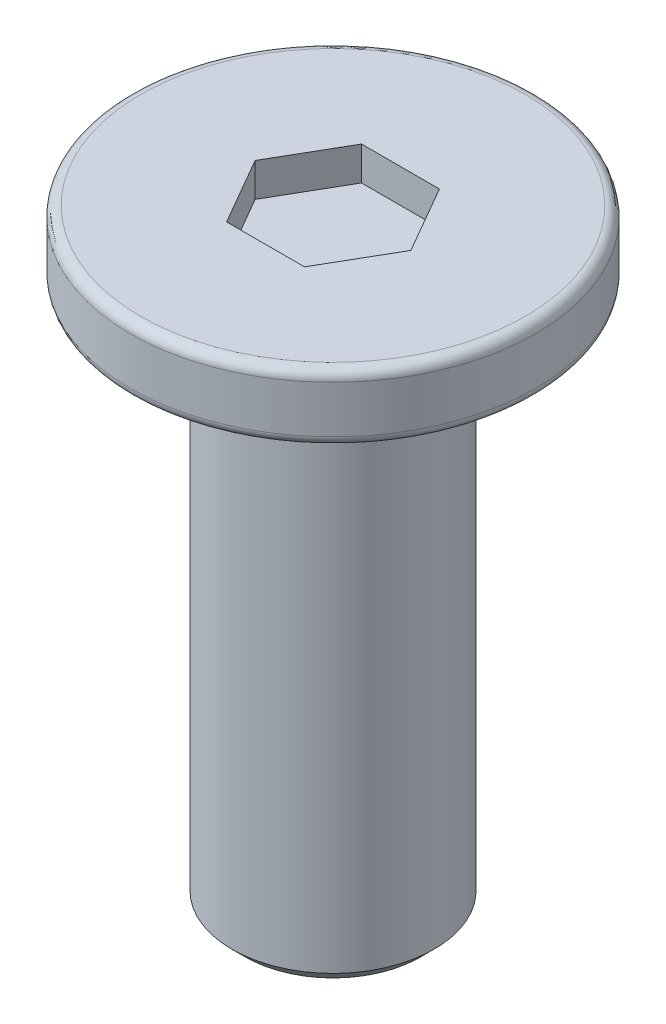
ISO-10303-21;
HEADER;
FILE_DESCRIPTION(('STEP AP214'),'2;1');
FILE_NAME('part.step','',(''),(''),'','','');
FILE_SCHEMA(('AUTOMOTIVE_DESIGN { 1 0 10303 214 1 1 1 1 }'));
ENDSEC;
DATA;
#1=APPLICATION_CONTEXT('core data for automotive mechanical design processes');
#2=APPLICATION_PROTOCOL_DEFINITION('international standard','automotive_design',2000,#1);
#3=PRODUCT_CONTEXT('',#1,'mechanical');
#4=PRODUCT('Part','Part','',(#3));
#5=PRODUCT_RELATED_PRODUCT_CATEGORY('part','',(#4));
#6=PRODUCT_DEFINITION_FORMATION('','',#4);
#7=PRODUCT_DEFINITION_CONTEXT('part definition',#1,'design');
#8=PRODUCT_DEFINITION('design','',#6,#7);
#9=PRODUCT_DEFINITION_SHAPE('','',#8);
#10=(LENGTH_UNIT() NAMED_UNIT(*) SI_UNIT(.MILLI.,.METRE.));
#11=(NAMED_UNIT(*) PLANE_ANGLE_UNIT() SI_UNIT($,.RADIAN.));
#12=(NAMED_UNIT(*) SI_UNIT($,.STERADIAN.) SOLID_ANGLE_UNIT());
#13=UNCERTAINTY_MEASURE_WITH_UNIT(LENGTH_MEASURE(1.E-05),#10,'distance_accuracy_value','');
#14=(GEOMETRIC_REPRESENTATION_CONTEXT(3) GLOBAL_UNCERTAINTY_ASSIGNED_CONTEXT((#13)) GLOBAL_UNIT_ASSIGNED_CONTEXT((#10,
#11,#12)) REPRESENTATION_CONTEXT('',''));
#15=CARTESIAN_POINT('',(0.,0.,0.));
#16=DIRECTION('',(0.,0.,1.));
#17=DIRECTION('',(1.,0.,0.));
#18=AXIS2_PLACEMENT_3D('',#15,#16,#17);
#19=CARTESIAN_POINT('',(0.,1.,0.));
#20=DIRECTION('',(0.,-1.,0.));
#21=DIRECTION('',(0.,0.,-1.));
#22=AXIS2_PLACEMENT_3D('',#19,#20,#21);
#23=CYLINDRICAL_SURFACE('',#22,3.);
#24=CARTESIAN_POINT('',(0.,0.15,0.));
#25=DIRECTION('',(0.,1.,0.));
#26=DIRECTION('',(0.,0.,1.));
#27=AXIS2_PLACEMENT_3D('',#24,#25,#26);
#28=CIRCLE('',#27,3.);
#29=CARTESIAN_POINT('',(0.,0.15,3.));
#30=VERTEX_POINT('',#29);
#31=EDGE_CURVE('E174',#30,#30,#28,.T.);
#32=ORIENTED_EDGE('',*,*,#31,.T.);
#33=EDGE_LOOP('',(#32));
#34=FACE_BOUND('',#33,.T.);
#35=CARTESIAN_POINT('',(0.,0.85,0.));
#36=DIRECTION('',(0.,1.,0.));
#37=DIRECTION('',(0.,0.,1.));
#38=AXIS2_PLACEMENT_3D('',#35,#36,#37);
#39=CIRCLE('',#38,3.);
#40=CARTESIAN_POINT('',(0.,0.85,3.));
#41=VERTEX_POINT('',#40);
#42=EDGE_CURVE('E170',#41,#41,#39,.F.);
#43=ORIENTED_EDGE('',*,*,#42,.T.);
#44=EDGE_LOOP('',(#43));
#45=FACE_BOUND('',#44,.T.);
#46=ADVANCED_FACE('F41',(#34,#45),#23,.T.);
#47=CARTESIAN_POINT('',(0.,1.,0.));
#48=DIRECTION('',(0.,1.,0.));
#49=DIRECTION('',(0.,0.,1.));
#50=AXIS2_PLACEMENT_3D('',#47,#48,#49);
#51=PLANE('',#50);
#52=DIRECTION('',(0.5,0.,-0.866025403784439));
#53=VECTOR('',#52,1.);
#54=CARTESIAN_POINT('',(0.577350269189626,1.,1.));
#55=LINE('',#54,#53);
#56=CARTESIAN_POINT('',(0.577350269189626,1.,1.));
#57=VERTEX_POINT('',#56);
#58=CARTESIAN_POINT('',(1.15470053837925,1.,0.));
#59=VERTEX_POINT('',#58);
#60=EDGE_CURVE('E58',#57,#59,#55,.T.);
#61=ORIENTED_EDGE('',*,*,#60,.F.);
#62=DIRECTION('',(1.,0.,0.));
#63=VECTOR('',#62,1.);
#64=CARTESIAN_POINT('',(-0.577350269189626,1.,1.));
#65=LINE('',#64,#63);
#66=CARTESIAN_POINT('',(-0.577350269189626,1.,1.));
#67=VERTEX_POINT('',#66);
#68=EDGE_CURVE('E151',#67,#57,#65,.T.);
#69=ORIENTED_EDGE('',*,*,#68,.F.);
#70=DIRECTION('',(0.5,0.,0.866025403784439));
#71=VECTOR('',#70,1.);
#72=CARTESIAN_POINT('',(-1.15470053837925,1.,0.));
#73=LINE('',#72,#71);
#74=CARTESIAN_POINT('',(-1.15470053837925,1.,0.));
#75=VERTEX_POINT('',#74);
#76=EDGE_CURVE('E148',#75,#67,#73,.T.);
#77=ORIENTED_EDGE('',*,*,#76,.F.);
#78=DIRECTION('',(-0.5,0.,0.866025403784439));
#79=VECTOR('',#78,1.);
#80=CARTESIAN_POINT('',(-0.577350269189626,1.,-1.));
#81=LINE('',#80,#79);
#82=CARTESIAN_POINT('',(-0.577350269189626,1.,-1.));
#83=VERTEX_POINT('',#82);
#84=EDGE_CURVE('E106',#83,#75,#81,.T.);
#85=ORIENTED_EDGE('',*,*,#84,.F.);
#86=DIRECTION('',(-1.,0.,0.));
#87=VECTOR('',#86,1.);
#88=CARTESIAN_POINT('',(0.577350269189625,1.,-1.));
#89=LINE('',#88,#87);
#90=CARTESIAN_POINT('',(0.577350269189625,1.,-1.));
#91=VERTEX_POINT('',#90);
#92=EDGE_CURVE('E142',#91,#83,#89,.T.);
#93=ORIENTED_EDGE('',*,*,#92,.F.);
#94=DIRECTION('',(-0.5,0.,-0.866025403784438));
#95=VECTOR('',#94,1.);
#96=CARTESIAN_POINT('',(1.15470053837925,1.,0.));
#97=LINE('',#96,#95);
#98=EDGE_CURVE('E138',#59,#91,#97,.T.);
#99=ORIENTED_EDGE('',*,*,#98,.F.);
#100=EDGE_LOOP('',(#61,#69,#77,#85,#93,#99));
#101=FACE_BOUND('',#100,.T.);
#102=CARTESIAN_POINT('',(0.,1.,0.));
#103=DIRECTION('',(0.,1.,0.));
#104=DIRECTION('',(0.,0.,1.));
#105=AXIS2_PLACEMENT_3D('',#102,#103,#104);
#106=CIRCLE('',#105,2.85);
#107=CARTESIAN_POINT('',(0.,1.,2.85));
#108=VERTEX_POINT('',#107);
#109=EDGE_CURVE('E182',#108,#108,#106,.T.);
#110=ORIENTED_EDGE('',*,*,#109,.T.);
#111=EDGE_LOOP('',(#110));
#112=FACE_BOUND('',#111,.T.);
#113=ADVANCED_FACE('F205',(#101,#112),#51,.T.);
#114=CARTESIAN_POINT('',(0.,0.,0.));
#115=DIRECTION('',(0.,1.,0.));
#116=DIRECTION('',(0.,0.,1.));
#117=AXIS2_PLACEMENT_3D('',#114,#115,#116);
#118=PLANE('',#117);
#119=CARTESIAN_POINT('',(0.,0.,0.));
#120=DIRECTION('',(0.,1.,0.));
#121=DIRECTION('',(0.,0.,1.));
#122=AXIS2_PLACEMENT_3D('',#119,#120,#121);
#123=CIRCLE('',#122,2.85);
#124=CARTESIAN_POINT('',(0.,0.,2.85));
#125=VERTEX_POINT('',#124);
#126=EDGE_CURVE('E178',#125,#125,#123,.F.);
#127=ORIENTED_EDGE('',*,*,#126,.T.);
#128=EDGE_LOOP('',(#127));
#129=FACE_BOUND('',#128,.T.);
#130=CARTESIAN_POINT('',(0.,0.,0.));
#131=DIRECTION('',(0.,-1.,0.));
#132=DIRECTION('',(0.,0.,-1.));
#133=AXIS2_PLACEMENT_3D('',#130,#131,#132);
#134=CIRCLE('',#133,1.5);
#135=CARTESIAN_POINT('',(0.,0.,-1.5));
#136=VERTEX_POINT('',#135);
#137=EDGE_CURVE('E157',#136,#136,#134,.T.);
#138=ORIENTED_EDGE('',*,*,#137,.F.);
#139=EDGE_LOOP('',(#138));
#140=FACE_BOUND('',#139,.T.);
#141=ADVANCED_FACE('F211',(#129,#140),#118,.F.);
#142=CARTESIAN_POINT('',(0.,-8.,0.));
#143=DIRECTION('',(0.,1.,0.));
#144=DIRECTION('',(0.,0.,1.));
#145=AXIS2_PLACEMENT_3D('',#142,#143,#144);
#146=CYLINDRICAL_SURFACE('',#145,1.5);
#147=CARTESIAN_POINT('',(0.,-7.8,0.));
#148=DIRECTION('',(0.,-1.,0.));
#149=DIRECTION('',(0.,0.,-1.));
#150=AXIS2_PLACEMENT_3D('',#147,#148,#149);
#151=CIRCLE('',#150,1.5);
#152=CARTESIAN_POINT('',(0.,-7.8,-1.5));
#153=VERTEX_POINT('',#152);
#154=EDGE_CURVE('E11',#153,#153,#151,.F.);
#155=ORIENTED_EDGE('',*,*,#154,.T.);
#156=EDGE_LOOP('',(#155));
#157=FACE_BOUND('',#156,.T.);
#158=ORIENTED_EDGE('',*,*,#137,.T.);
#159=EDGE_LOOP('',(#158));
#160=FACE_BOUND('',#159,.T.);
#161=ADVANCED_FACE('F222',(#157,#160),#146,.T.);
#162=CARTESIAN_POINT('',(0.,-8.,0.));
#163=DIRECTION('',(0.,-1.,0.));
#164=DIRECTION('',(0.,0.,-1.));
#165=AXIS2_PLACEMENT_3D('',#162,#163,#164);
#166=PLANE('',#165);
#167=CARTESIAN_POINT('',(0.,-8.,0.));
#168=DIRECTION('',(0.,-1.,0.));
#169=DIRECTION('',(0.,0.,-1.));
#170=AXIS2_PLACEMENT_3D('',#167,#168,#169);
#171=CIRCLE('',#170,1.3);
#172=CARTESIAN_POINT('',(0.,-8.,-1.3));
#173=VERTEX_POINT('',#172);
#174=EDGE_CURVE('E51',#173,#173,#171,.T.);
#175=ORIENTED_EDGE('',*,*,#174,.T.);
#176=EDGE_LOOP('',(#175));
#177=FACE_BOUND('',#176,.T.);
#178=ADVANCED_FACE('F189',(#177),#166,.T.);
#179=CARTESIAN_POINT('',(0.,0.15,0.));
#180=DIRECTION('',(0.,1.,0.));
#181=DIRECTION('',(0.,0.,1.));
#182=AXIS2_PLACEMENT_3D('',#179,#180,#181);
#183=TOROIDAL_SURFACE('',#182,2.85,0.15);
#184=ORIENTED_EDGE('',*,*,#126,.F.);
#185=EDGE_LOOP('',(#184));
#186=FACE_BOUND('',#185,.T.);
#187=ORIENTED_EDGE('',*,*,#31,.F.);
#188=EDGE_LOOP('',(#187));
#189=FACE_BOUND('',#188,.T.);
#190=ADVANCED_FACE('F201',(#186,#189),#183,.T.);
#191=CARTESIAN_POINT('',(0.,0.85,0.));
#192=DIRECTION('',(0.,1.,0.));
#193=DIRECTION('',(0.,0.,1.));
#194=AXIS2_PLACEMENT_3D('',#191,#192,#193);
#195=TOROIDAL_SURFACE('',#194,2.85,0.15);
#196=ORIENTED_EDGE('',*,*,#42,.F.);
#197=EDGE_LOOP('',(#196));
#198=FACE_BOUND('',#197,.T.);
#199=ORIENTED_EDGE('',*,*,#109,.F.);
#200=EDGE_LOOP('',(#199));
#201=FACE_BOUND('',#200,.T.);
#202=ADVANCED_FACE('F193',(#198,#201),#195,.T.);
#203=CARTESIAN_POINT('',(0.,-8.,0.));
#204=DIRECTION('',(0.,1.,0.));
#205=DIRECTION('',(0.,0.,1.));
#206=AXIS2_PLACEMENT_3D('',#203,#204,#205);
#207=CONICAL_SURFACE('',#206,1.3,0.78539816339745);
#208=ORIENTED_EDGE('',*,*,#154,.F.);
#209=EDGE_LOOP('',(#208));
#210=FACE_BOUND('',#209,.T.);
#211=ORIENTED_EDGE('',*,*,#174,.F.);
#212=EDGE_LOOP('',(#211));
#213=FACE_BOUND('',#212,.T.);
#214=ADVANCED_FACE('F44',(#210,#213),#207,.T.);
#215=CARTESIAN_POINT('',(0.577350269189626,0.5,1.));
#216=DIRECTION('',(0.866025403784439,0.,0.5));
#217=DIRECTION('',(0.5,0.,-0.866025403784439));
#218=AXIS2_PLACEMENT_3D('',#215,#216,#217);
#219=PLANE('',#218);
#220=ORIENTED_EDGE('',*,*,#60,.T.);
#221=DIRECTION('',(0.,1.,0.));
#222=VECTOR('',#221,1.);
#223=CARTESIAN_POINT('',(1.15470053837925,0.5,0.));
#224=LINE('',#223,#222);
#225=CARTESIAN_POINT('',(1.15470053837925,0.5,0.));
#226=VERTEX_POINT('',#225);
#227=EDGE_CURVE('E88',#226,#59,#224,.T.);
#228=ORIENTED_EDGE('',*,*,#227,.F.);
#229=DIRECTION('',(0.5,0.,-0.866025403784439));
#230=VECTOR('',#229,1.);
#231=CARTESIAN_POINT('',(0.577350269189626,0.5,1.));
#232=LINE('',#231,#230);
#233=CARTESIAN_POINT('',(0.577350269189626,0.5,1.));
#234=VERTEX_POINT('',#233);
#235=EDGE_CURVE('E154',#234,#226,#232,.T.);
#236=ORIENTED_EDGE('',*,*,#235,.F.);
#237=DIRECTION('',(0.,1.,0.));
#238=VECTOR('',#237,1.);
#239=CARTESIAN_POINT('',(0.577350269189626,0.5,1.));
#240=LINE('',#239,#238);
#241=EDGE_CURVE('E66',#234,#57,#240,.T.);
#242=ORIENTED_EDGE('',*,*,#241,.T.);
#243=EDGE_LOOP('',(#220,#228,#236,#242));
#244=FACE_BOUND('',#243,.T.);
#245=ADVANCED_FACE('F192',(#244),#219,.F.);
#246=CARTESIAN_POINT('',(-0.577350269189626,0.5,1.));
#247=DIRECTION('',(0.,0.,1.));
#248=DIRECTION('',(1.,0.,0.));
#249=AXIS2_PLACEMENT_3D('',#246,#247,#248);
#250=PLANE('',#249);
#251=ORIENTED_EDGE('',*,*,#68,.T.);
#252=ORIENTED_EDGE('',*,*,#241,.F.);
#253=DIRECTION('',(1.,0.,0.));
#254=VECTOR('',#253,1.);
#255=CARTESIAN_POINT('',(-0.577350269189626,0.5,1.));
#256=LINE('',#255,#254);
#257=CARTESIAN_POINT('',(-0.577350269189626,0.5,1.));
#258=VERTEX_POINT('',#257);
#259=EDGE_CURVE('E120',#258,#234,#256,.T.);
#260=ORIENTED_EDGE('',*,*,#259,.F.);
#261=DIRECTION('',(0.,1.,0.));
#262=VECTOR('',#261,1.);
#263=CARTESIAN_POINT('',(-0.577350269189626,0.5,1.));
#264=LINE('',#263,#262);
#265=EDGE_CURVE('E111',#258,#67,#264,.T.);
#266=ORIENTED_EDGE('',*,*,#265,.T.);
#267=EDGE_LOOP('',(#251,#252,#260,#266));
#268=FACE_BOUND('',#267,.T.);
#269=ADVANCED_FACE('F199',(#268),#250,.F.);
#270=CARTESIAN_POINT('',(-1.15470053837925,0.5,0.));
#271=DIRECTION('',(-0.866025403784439,0.,0.5));
#272=DIRECTION('',(0.5,0.,0.866025403784439));
#273=AXIS2_PLACEMENT_3D('',#270,#271,#272);
#274=PLANE('',#273);
#275=ORIENTED_EDGE('',*,*,#76,.T.);
#276=ORIENTED_EDGE('',*,*,#265,.F.);
#277=DIRECTION('',(0.5,0.,0.866025403784439));
#278=VECTOR('',#277,1.);
#279=CARTESIAN_POINT('',(-1.15470053837925,0.5,0.));
#280=LINE('',#279,#278);
#281=CARTESIAN_POINT('',(-1.15470053837925,0.5,0.));
#282=VERTEX_POINT('',#281);
#283=EDGE_CURVE('E115',#282,#258,#280,.T.);
#284=ORIENTED_EDGE('',*,*,#283,.F.);
#285=DIRECTION('',(0.,1.,0.));
#286=VECTOR('',#285,1.);
#287=CARTESIAN_POINT('',(-1.15470053837925,0.5,0.));
#288=LINE('',#287,#286);
#289=EDGE_CURVE('E99',#282,#75,#288,.T.);
#290=ORIENTED_EDGE('',*,*,#289,.T.);
#291=EDGE_LOOP('',(#275,#276,#284,#290));
#292=FACE_BOUND('',#291,.T.);
#293=ADVANCED_FACE('F116',(#292),#274,.F.);
#294=CARTESIAN_POINT('',(-0.577350269189626,0.5,-1.));
#295=DIRECTION('',(-0.866025403784439,0.,-0.5));
#296=DIRECTION('',(-0.5,0.,0.866025403784439));
#297=AXIS2_PLACEMENT_3D('',#294,#295,#296);
#298=PLANE('',#297);
#299=ORIENTED_EDGE('',*,*,#84,.T.);
#300=ORIENTED_EDGE('',*,*,#289,.F.);
#301=DIRECTION('',(-0.5,0.,0.866025403784439));
#302=VECTOR('',#301,1.);
#303=CARTESIAN_POINT('',(-0.577350269189626,0.5,-1.));
#304=LINE('',#303,#302);
#305=CARTESIAN_POINT('',(-0.577350269189626,0.5,-1.));
#306=VERTEX_POINT('',#305);
#307=EDGE_CURVE('E103',#306,#282,#304,.T.);
#308=ORIENTED_EDGE('',*,*,#307,.F.);
#309=DIRECTION('',(0.,1.,0.));
#310=VECTOR('',#309,1.);
#311=CARTESIAN_POINT('',(-0.577350269189626,0.5,-1.));
#312=LINE('',#311,#310);
#313=EDGE_CURVE('E112',#306,#83,#312,.T.);
#314=ORIENTED_EDGE('',*,*,#313,.T.);
#315=EDGE_LOOP('',(#299,#300,#308,#314));
#316=FACE_BOUND('',#315,.T.);
#317=ADVANCED_FACE('F101',(#316),#298,.F.);
#318=CARTESIAN_POINT('',(0.577350269189625,0.5,-1.));
#319=DIRECTION('',(0.,0.,-1.));
#320=DIRECTION('',(-1.,0.,0.));
#321=AXIS2_PLACEMENT_3D('',#318,#319,#320);
#322=PLANE('',#321);
#323=ORIENTED_EDGE('',*,*,#92,.T.);
#324=ORIENTED_EDGE('',*,*,#313,.F.);
#325=DIRECTION('',(-1.,0.,0.));
#326=VECTOR('',#325,1.);
#327=CARTESIAN_POINT('',(0.577350269189625,0.5,-1.));
#328=LINE('',#327,#326);
#329=CARTESIAN_POINT('',(0.577350269189625,0.5,-1.));
#330=VERTEX_POINT('',#329);
#331=EDGE_CURVE('E126',#330,#306,#328,.T.);
#332=ORIENTED_EDGE('',*,*,#331,.F.);
#333=DIRECTION('',(0.,1.,0.));
#334=VECTOR('',#333,1.);
#335=CARTESIAN_POINT('',(0.577350269189625,0.5,-1.));
#336=LINE('',#335,#334);
#337=EDGE_CURVE('E162',#330,#91,#336,.T.);
#338=ORIENTED_EDGE('',*,*,#337,.T.);
#339=EDGE_LOOP('',(#323,#324,#332,#338));
#340=FACE_BOUND('',#339,.T.);
#341=ADVANCED_FACE('F241',(#340),#322,.F.);
#342=CARTESIAN_POINT('',(1.15470053837925,0.5,0.));
#343=DIRECTION('',(0.866025403784438,0.,-0.5));
#344=DIRECTION('',(-0.5,0.,-0.866025403784438));
#345=AXIS2_PLACEMENT_3D('',#342,#343,#344);
#346=PLANE('',#345);
#347=ORIENTED_EDGE('',*,*,#98,.T.);
#348=ORIENTED_EDGE('',*,*,#337,.F.);
#349=DIRECTION('',(-0.5,0.,-0.866025403784438));
#350=VECTOR('',#349,1.);
#351=CARTESIAN_POINT('',(1.15470053837925,0.5,0.));
#352=LINE('',#351,#350);
#353=EDGE_CURVE('E130',#226,#330,#352,.T.);
#354=ORIENTED_EDGE('',*,*,#353,.F.);
#355=ORIENTED_EDGE('',*,*,#227,.T.);
#356=EDGE_LOOP('',(#347,#348,#354,#355));
#357=FACE_BOUND('',#356,.T.);
#358=ADVANCED_FACE('F238',(#357),#346,.F.);
#359=CARTESIAN_POINT('',(0.,0.5,0.));
#360=DIRECTION('',(0.,1.,0.));
#361=DIRECTION('',(0.,0.,1.));
#362=AXIS2_PLACEMENT_3D('',#359,#360,#361);
#363=PLANE('',#362);
#364=ORIENTED_EDGE('',*,*,#235,.T.);
#365=ORIENTED_EDGE('',*,*,#353,.T.);
#366=ORIENTED_EDGE('',*,*,#331,.T.);
#367=ORIENTED_EDGE('',*,*,#307,.T.);
#368=ORIENTED_EDGE('',*,*,#283,.T.);
#369=ORIENTED_EDGE('',*,*,#259,.T.);
#370=EDGE_LOOP('',(#364,#365,#366,#367,#368,#369));
#371=FACE_BOUND('',#370,.T.);
#372=ADVANCED_FACE('F123',(#371),#363,.T.);
#373=CLOSED_SHELL('',(#46,#113,#141,#161,#178,#190,#202,#214,#245,#269,#293,#317,#341,#358,#372));
#374=MANIFOLD_SOLID_BREP('B2',#373);
#375=ADVANCED_BREP_SHAPE_REPRESENTATION('',(#18,#374),#14);
#376=SHAPE_DEFINITION_REPRESENTATION(#9,#375);
ENDSEC;
END-ISO-10303-21;
